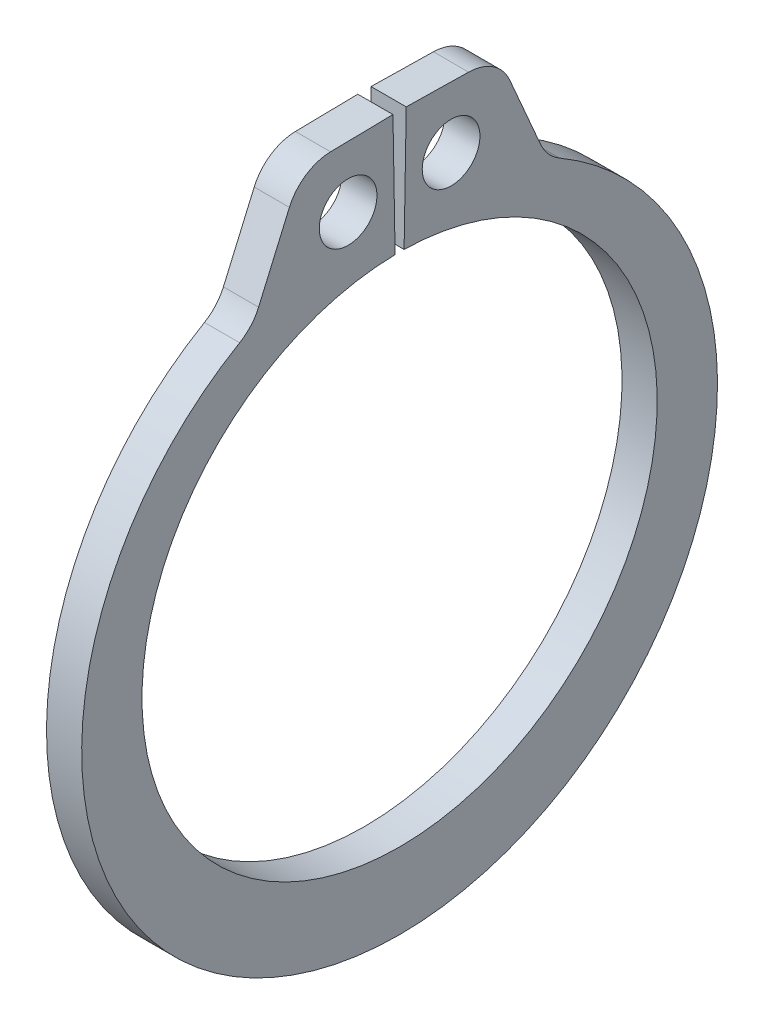
ISO-10303-21;
HEADER;
FILE_DESCRIPTION(('STEP AP214'),'2;1');
FILE_NAME('part.step','',(''),(''),'','','');
FILE_SCHEMA(('AUTOMOTIVE_DESIGN { 1 0 10303 214 1 1 1 1 }'));
ENDSEC;
DATA;
#1=APPLICATION_CONTEXT('core data for automotive mechanical design processes');
#2=APPLICATION_PROTOCOL_DEFINITION('international standard','automotive_design',2000,#1);
#3=PRODUCT_CONTEXT('',#1,'mechanical');
#4=PRODUCT('Part','Part','',(#3));
#5=PRODUCT_RELATED_PRODUCT_CATEGORY('part','',(#4));
#6=PRODUCT_DEFINITION_FORMATION('','',#4);
#7=PRODUCT_DEFINITION_CONTEXT('part definition',#1,'design');
#8=PRODUCT_DEFINITION('design','',#6,#7);
#9=PRODUCT_DEFINITION_SHAPE('','',#8);
#10=(LENGTH_UNIT() NAMED_UNIT(*) SI_UNIT(.MILLI.,.METRE.));
#11=(NAMED_UNIT(*) PLANE_ANGLE_UNIT() SI_UNIT($,.RADIAN.));
#12=(NAMED_UNIT(*) SI_UNIT($,.STERADIAN.) SOLID_ANGLE_UNIT());
#13=UNCERTAINTY_MEASURE_WITH_UNIT(LENGTH_MEASURE(1.E-05),#10,'distance_accuracy_value','');
#14=(GEOMETRIC_REPRESENTATION_CONTEXT(3) GLOBAL_UNCERTAINTY_ASSIGNED_CONTEXT((#13)) GLOBAL_UNIT_ASSIGNED_CONTEXT((#10,
#11,#12)) REPRESENTATION_CONTEXT('',''));
#15=CARTESIAN_POINT('',(0.,0.,0.));
#16=DIRECTION('',(0.,0.,1.));
#17=DIRECTION('',(1.,0.,0.));
#18=AXIS2_PLACEMENT_3D('',#15,#16,#17);
#19=CARTESIAN_POINT('',(0.3175,0.,0.));
#20=DIRECTION('',(1.,0.,0.));
#21=DIRECTION('',(0.,0.,-1.));
#22=AXIS2_PLACEMENT_3D('',#19,#20,#21);
#23=PLANE('',#22);
#24=CARTESIAN_POINT('',(0.3175,5.73776140209981,-0.92895422825804));
#25=DIRECTION('',(-1.,0.,0.));
#26=DIRECTION('',(0.,0.,1.));
#27=AXIS2_PLACEMENT_3D('',#24,#25,#26);
#28=CIRCLE('',#27,0.5207);
#29=CARTESIAN_POINT('',(0.3175,5.73776140209981,-0.40825422825804));
#30=VERTEX_POINT('',#29);
#31=EDGE_CURVE('E107',#30,#30,#28,.T.);
#32=ORIENTED_EDGE('',*,*,#31,.T.);
#33=EDGE_LOOP('',(#32));
#34=FACE_BOUND('',#33,.T.);
#35=CARTESIAN_POINT('',(0.3175,0.,0.));
#36=DIRECTION('',(-1.,0.,0.));
#37=DIRECTION('',(0.,0.,1.));
#38=AXIS2_PLACEMENT_3D('',#35,#36,#37);
#39=CIRCLE('',#38,4.64820000000001);
#40=CARTESIAN_POINT('',(0.3175,4.64749205662594,-0.0811222756017819));
#41=VERTEX_POINT('',#40);
#42=CARTESIAN_POINT('',(0.3175,4.64749205662594,0.0811222756017817));
#43=VERTEX_POINT('',#42);
#44=EDGE_CURVE('E165',#41,#43,#39,.T.);
#45=ORIENTED_EDGE('',*,*,#44,.T.);
#46=DIRECTION('',(0.,-0.999847695156391,-0.0174524064372834));
#47=VECTOR('',#46,1.);
#48=CARTESIAN_POINT('',(0.3175,4.64749205662594,0.0811222756017817));
#49=LINE('',#48,#47);
#50=CARTESIAN_POINT('',(0.3175,6.85695549338253,0.11968860334689));
#51=VERTEX_POINT('',#50);
#52=EDGE_CURVE('E121',#43,#51,#49,.F.);
#53=ORIENTED_EDGE('',*,*,#52,.T.);
#54=DIRECTION('',(0.,0.0174524064372746,-0.999847695156391));
#55=VECTOR('',#54,1.);
#56=CARTESIAN_POINT('',(0.3175,6.85695549338253,0.11968860334689));
#57=LINE('',#56,#55);
#58=CARTESIAN_POINT('',(0.3175,6.83730746393553,1.24532345648589));
#59=VERTEX_POINT('',#58);
#60=EDGE_CURVE('E118',#51,#59,#57,.F.);
#61=ORIENTED_EDGE('',*,*,#60,.T.);
#62=CARTESIAN_POINT('',(0.3175,6.01193319158393,1.23091649497192));
#63=DIRECTION('',(-1.,0.,0.));
#64=DIRECTION('',(0.,0.,1.));
#65=AXIS2_PLACEMENT_3D('',#62,#63,#64);
#66=CIRCLE('',#65,0.8255);
#67=CARTESIAN_POINT('',(0.3175,6.34036860190848,1.98826742502017));
#68=VERTEX_POINT('',#67);
#69=EDGE_CURVE('E111',#68,#59,#66,.T.);
#70=ORIENTED_EDGE('',*,*,#69,.F.);
#71=DIRECTION('',(0.,0.917445099997873,-0.397862398939498));
#72=VECTOR('',#71,1.);
#73=CARTESIAN_POINT('',(0.3175,6.82803074757371,1.77678618091434));
#74=LINE('',#73,#72);
#75=CARTESIAN_POINT('',(0.3175,5.05860230061111,2.54412260972295));
#76=VERTEX_POINT('',#75);
#77=EDGE_CURVE('E106',#68,#76,#74,.F.);
#78=ORIENTED_EDGE('',*,*,#77,.T.);
#79=CARTESIAN_POINT('',(0.3175,5.38703771093567,3.30147353977119));
#80=DIRECTION('',(-1.,0.,0.));
#81=DIRECTION('',(0.,0.,1.));
#82=AXIS2_PLACEMENT_3D('',#79,#80,#81);
#83=CIRCLE('',#82,0.8255);
#84=CARTESIAN_POINT('',(0.3175,4.6736380727081,2.88612885619287));
#85=VERTEX_POINT('',#84);
#86=EDGE_CURVE('E97',#76,#85,#83,.T.);
#87=ORIENTED_EDGE('',*,*,#86,.T.);
#88=CARTESIAN_POINT('',(0.3175,-0.283601933706637,0.));
#89=DIRECTION('',(-1.,0.,0.));
#90=DIRECTION('',(0.,0.,1.));
#91=AXIS2_PLACEMENT_3D('',#88,#89,#90);
#92=CIRCLE('',#91,5.73619806629338);
#93=CARTESIAN_POINT('',(0.3175,4.6736380727081,-2.88612885619287));
#94=VERTEX_POINT('',#93);
#95=EDGE_CURVE('E172',#94,#85,#92,.T.);
#96=ORIENTED_EDGE('',*,*,#95,.F.);
#97=CARTESIAN_POINT('',(0.3175,5.38703771093567,-3.30147353977119));
#98=DIRECTION('',(-1.,0.,0.));
#99=DIRECTION('',(0.,0.,1.));
#100=AXIS2_PLACEMENT_3D('',#97,#98,#99);
#101=CIRCLE('',#100,0.8255);
#102=CARTESIAN_POINT('',(0.3175,5.05860230061111,-2.54412260972295));
#103=VERTEX_POINT('',#102);
#104=EDGE_CURVE('E169',#94,#103,#101,.T.);
#105=ORIENTED_EDGE('',*,*,#104,.T.);
#106=DIRECTION('',(0.,-0.917445099997873,-0.397862398939498));
#107=VECTOR('',#106,1.);
#108=CARTESIAN_POINT('',(0.3175,6.82803074757371,-1.77678618091434));
#109=LINE('',#108,#107);
#110=CARTESIAN_POINT('',(0.3175,6.34036860190848,-1.98826742502017));
#111=VERTEX_POINT('',#110);
#112=EDGE_CURVE('E134',#103,#111,#109,.F.);
#113=ORIENTED_EDGE('',*,*,#112,.T.);
#114=CARTESIAN_POINT('',(0.3175,6.01193319158393,-1.23091649497192));
#115=DIRECTION('',(-1.,0.,0.));
#116=DIRECTION('',(0.,0.,1.));
#117=AXIS2_PLACEMENT_3D('',#114,#115,#116);
#118=CIRCLE('',#117,0.8255);
#119=CARTESIAN_POINT('',(0.3175,6.83730746393553,-1.24532345648589));
#120=VERTEX_POINT('',#119);
#121=EDGE_CURVE('E136',#120,#111,#118,.T.);
#122=ORIENTED_EDGE('',*,*,#121,.F.);
#123=DIRECTION('',(0.,-0.0174524064372746,-0.999847695156391));
#124=VECTOR('',#123,1.);
#125=CARTESIAN_POINT('',(0.3175,6.85695549338253,-0.11968860334689));
#126=LINE('',#125,#124);
#127=CARTESIAN_POINT('',(0.3175,6.85695549338253,-0.11968860334689));
#128=VERTEX_POINT('',#127);
#129=EDGE_CURVE('E130',#120,#128,#126,.F.);
#130=ORIENTED_EDGE('',*,*,#129,.T.);
#131=DIRECTION('',(0.,0.999847695156391,-0.0174524064372834));
#132=VECTOR('',#131,1.);
#133=CARTESIAN_POINT('',(0.3175,4.64749205662594,-0.0811222756017817));
#134=LINE('',#133,#132);
#135=EDGE_CURVE('E125',#128,#41,#134,.F.);
#136=ORIENTED_EDGE('',*,*,#135,.T.);
#137=EDGE_LOOP('',(#45,#53,#61,#70,#78,#87,#96,#105,#113,#122,#130,#136));
#138=FACE_BOUND('',#137,.T.);
#139=CARTESIAN_POINT('',(0.3175,5.73776140209981,0.92895422825804));
#140=DIRECTION('',(-1.,0.,0.));
#141=DIRECTION('',(0.,0.,1.));
#142=AXIS2_PLACEMENT_3D('',#139,#140,#141);
#143=CIRCLE('',#142,0.5207);
#144=CARTESIAN_POINT('',(0.3175,5.73776140209981,1.44965422825804));
#145=VERTEX_POINT('',#144);
#146=EDGE_CURVE('E19',#145,#145,#143,.T.);
#147=ORIENTED_EDGE('',*,*,#146,.T.);
#148=EDGE_LOOP('',(#147));
#149=FACE_BOUND('',#148,.T.);
#150=ADVANCED_FACE('F16',(#34,#138,#149),#23,.T.);
#151=CARTESIAN_POINT('',(0.3175,5.73776140209981,0.92895422825804));
#152=DIRECTION('',(-1.,0.,0.));
#153=DIRECTION('',(0.,0.,1.));
#154=AXIS2_PLACEMENT_3D('',#151,#152,#153);
#155=CYLINDRICAL_SURFACE('',#154,0.5207);
#156=CARTESIAN_POINT('',(-0.3175,5.73776140209981,0.92895422825804));
#157=DIRECTION('',(-1.,0.,0.));
#158=DIRECTION('',(0.,0.,1.));
#159=AXIS2_PLACEMENT_3D('',#156,#157,#158);
#160=CIRCLE('',#159,0.5207);
#161=CARTESIAN_POINT('',(-0.3175,5.73776140209981,1.44965422825804));
#162=VERTEX_POINT('',#161);
#163=EDGE_CURVE('E159',#162,#162,#160,.T.);
#164=ORIENTED_EDGE('',*,*,#163,.T.);
#165=EDGE_LOOP('',(#164));
#166=FACE_BOUND('',#165,.T.);
#167=ORIENTED_EDGE('',*,*,#146,.F.);
#168=EDGE_LOOP('',(#167));
#169=FACE_BOUND('',#168,.T.);
#170=ADVANCED_FACE('F367',(#166,#169),#155,.F.);
#171=CARTESIAN_POINT('',(0.3175,5.38703771093567,3.30147353977119));
#172=DIRECTION('',(-1.,0.,0.));
#173=DIRECTION('',(0.,0.,1.));
#174=AXIS2_PLACEMENT_3D('',#171,#172,#173);
#175=CYLINDRICAL_SURFACE('',#174,0.8255);
#176=DIRECTION('',(1.,0.,0.));
#177=VECTOR('',#176,1.);
#178=CARTESIAN_POINT('',(0.3175,5.05860230061111,2.54412260972295));
#179=LINE('',#178,#177);
#180=CARTESIAN_POINT('',(-0.3175,5.05860230061111,2.54412260972295));
#181=VERTEX_POINT('',#180);
#182=EDGE_CURVE('E101',#76,#181,#179,.F.);
#183=ORIENTED_EDGE('',*,*,#182,.T.);
#184=CARTESIAN_POINT('',(-0.3175,5.38703771093567,3.30147353977119));
#185=DIRECTION('',(-1.,0.,0.));
#186=DIRECTION('',(0.,0.,1.));
#187=AXIS2_PLACEMENT_3D('',#184,#185,#186);
#188=CIRCLE('',#187,0.8255);
#189=CARTESIAN_POINT('',(-0.3175,4.6736380727081,2.88612885619287));
#190=VERTEX_POINT('',#189);
#191=EDGE_CURVE('E157',#181,#190,#188,.T.);
#192=ORIENTED_EDGE('',*,*,#191,.T.);
#193=DIRECTION('',(-1.,0.,0.));
#194=VECTOR('',#193,1.);
#195=CARTESIAN_POINT('',(0.3175,4.6736380727081,2.88612885619287));
#196=LINE('',#195,#194);
#197=EDGE_CURVE('E102',#85,#190,#196,.T.);
#198=ORIENTED_EDGE('',*,*,#197,.F.);
#199=ORIENTED_EDGE('',*,*,#86,.F.);
#200=EDGE_LOOP('',(#183,#192,#198,#199));
#201=FACE_BOUND('',#200,.T.);
#202=ADVANCED_FACE('F99',(#201),#175,.F.);
#203=CARTESIAN_POINT('',(0.3175,-0.283601933706637,0.));
#204=DIRECTION('',(-1.,0.,0.));
#205=DIRECTION('',(0.,0.,1.));
#206=AXIS2_PLACEMENT_3D('',#203,#204,#205);
#207=CYLINDRICAL_SURFACE('',#206,5.73619806629338);
#208=CARTESIAN_POINT('',(-0.3175,-0.283601933706637,0.));
#209=DIRECTION('',(-1.,0.,0.));
#210=DIRECTION('',(0.,0.,1.));
#211=AXIS2_PLACEMENT_3D('',#208,#209,#210);
#212=CIRCLE('',#211,5.73619806629338);
#213=CARTESIAN_POINT('',(-0.3175,4.6736380727081,-2.88612885619287));
#214=VERTEX_POINT('',#213);
#215=EDGE_CURVE('E155',#190,#214,#212,.F.);
#216=ORIENTED_EDGE('',*,*,#215,.T.);
#217=DIRECTION('',(-1.,0.,0.));
#218=VECTOR('',#217,1.);
#219=CARTESIAN_POINT('',(0.3175,4.6736380727081,-2.88612885619287));
#220=LINE('',#219,#218);
#221=EDGE_CURVE('E171',#214,#94,#220,.F.);
#222=ORIENTED_EDGE('',*,*,#221,.T.);
#223=ORIENTED_EDGE('',*,*,#95,.T.);
#224=ORIENTED_EDGE('',*,*,#197,.T.);
#225=EDGE_LOOP('',(#216,#222,#223,#224));
#226=FACE_BOUND('',#225,.T.);
#227=ADVANCED_FACE('F177',(#226),#207,.T.);
#228=CARTESIAN_POINT('',(0.3175,5.38703771093567,-3.30147353977119));
#229=DIRECTION('',(-1.,0.,0.));
#230=DIRECTION('',(0.,0.,1.));
#231=AXIS2_PLACEMENT_3D('',#228,#229,#230);
#232=CYLINDRICAL_SURFACE('',#231,0.8255);
#233=ORIENTED_EDGE('',*,*,#221,.F.);
#234=CARTESIAN_POINT('',(-0.3175,5.38703771093567,-3.30147353977119));
#235=DIRECTION('',(-1.,0.,0.));
#236=DIRECTION('',(0.,0.,1.));
#237=AXIS2_PLACEMENT_3D('',#234,#235,#236);
#238=CIRCLE('',#237,0.8255);
#239=CARTESIAN_POINT('',(-0.3175,5.05860230061111,-2.54412260972295));
#240=VERTEX_POINT('',#239);
#241=EDGE_CURVE('E152',#214,#240,#238,.T.);
#242=ORIENTED_EDGE('',*,*,#241,.T.);
#243=DIRECTION('',(1.,0.,0.));
#244=VECTOR('',#243,1.);
#245=CARTESIAN_POINT('',(0.3175,5.05860230061111,-2.54412260972295));
#246=LINE('',#245,#244);
#247=EDGE_CURVE('E137',#240,#103,#246,.T.);
#248=ORIENTED_EDGE('',*,*,#247,.T.);
#249=ORIENTED_EDGE('',*,*,#104,.F.);
#250=EDGE_LOOP('',(#233,#242,#248,#249));
#251=FACE_BOUND('',#250,.T.);
#252=ADVANCED_FACE('F189',(#251),#232,.F.);
#253=CARTESIAN_POINT('',(0.3175,6.82803074757371,-1.77678618091434));
#254=DIRECTION('',(0.,-0.397862398939498,0.917445099997873));
#255=DIRECTION('',(0.,-0.917445099997873,-0.397862398939498));
#256=AXIS2_PLACEMENT_3D('',#253,#254,#255);
#257=PLANE('',#256);
#258=ORIENTED_EDGE('',*,*,#247,.F.);
#259=DIRECTION('',(0.,0.917445099997873,0.397862398939498));
#260=VECTOR('',#259,1.);
#261=CARTESIAN_POINT('',(-0.3175,5.05860230061111,-2.54412260972295));
#262=LINE('',#261,#260);
#263=CARTESIAN_POINT('',(-0.3175,6.34036860190848,-1.98826742502017));
#264=VERTEX_POINT('',#263);
#265=EDGE_CURVE('E151',#240,#264,#262,.T.);
#266=ORIENTED_EDGE('',*,*,#265,.T.);
#267=DIRECTION('',(-1.,0.,0.));
#268=VECTOR('',#267,1.);
#269=CARTESIAN_POINT('',(0.3175,6.34036860190848,-1.98826742502017));
#270=LINE('',#269,#268);
#271=EDGE_CURVE('E168',#111,#264,#270,.T.);
#272=ORIENTED_EDGE('',*,*,#271,.F.);
#273=ORIENTED_EDGE('',*,*,#112,.F.);
#274=EDGE_LOOP('',(#258,#266,#272,#273));
#275=FACE_BOUND('',#274,.T.);
#276=ADVANCED_FACE('F194',(#275),#257,.F.);
#277=CARTESIAN_POINT('',(0.3175,6.01193319158393,-1.23091649497192));
#278=DIRECTION('',(-1.,0.,0.));
#279=DIRECTION('',(0.,0.,1.));
#280=AXIS2_PLACEMENT_3D('',#277,#278,#279);
#281=CYLINDRICAL_SURFACE('',#280,0.8255);
#282=CARTESIAN_POINT('',(-0.3175,6.01193319158393,-1.23091649497192));
#283=DIRECTION('',(-1.,0.,0.));
#284=DIRECTION('',(0.,0.,1.));
#285=AXIS2_PLACEMENT_3D('',#282,#283,#284);
#286=CIRCLE('',#285,0.8255);
#287=CARTESIAN_POINT('',(-0.3175,6.83730746393553,-1.24532345648589));
#288=VERTEX_POINT('',#287);
#289=EDGE_CURVE('E147',#264,#288,#286,.F.);
#290=ORIENTED_EDGE('',*,*,#289,.T.);
#291=DIRECTION('',(1.,0.,0.));
#292=VECTOR('',#291,1.);
#293=CARTESIAN_POINT('',(0.3175,6.83730746393553,-1.24532345648589));
#294=LINE('',#293,#292);
#295=EDGE_CURVE('E133',#288,#120,#294,.T.);
#296=ORIENTED_EDGE('',*,*,#295,.T.);
#297=ORIENTED_EDGE('',*,*,#121,.T.);
#298=ORIENTED_EDGE('',*,*,#271,.T.);
#299=EDGE_LOOP('',(#290,#296,#297,#298));
#300=FACE_BOUND('',#299,.T.);
#301=ADVANCED_FACE('F245',(#300),#281,.T.);
#302=CARTESIAN_POINT('',(0.3175,6.85695549338253,-0.11968860334689));
#303=DIRECTION('',(0.,-0.999847695156391,0.0174524064372746));
#304=DIRECTION('',(0.,-0.0174524064372746,-0.999847695156391));
#305=AXIS2_PLACEMENT_3D('',#302,#303,#304);
#306=PLANE('',#305);
#307=ORIENTED_EDGE('',*,*,#295,.F.);
#308=DIRECTION('',(0.,0.0174524064372745,0.999847695156391));
#309=VECTOR('',#308,1.);
#310=CARTESIAN_POINT('',(-0.3175,6.83730746393553,-1.24532345648589));
#311=LINE('',#310,#309);
#312=CARTESIAN_POINT('',(-0.3175,6.85695549338253,-0.11968860334689));
#313=VERTEX_POINT('',#312);
#314=EDGE_CURVE('E150',#288,#313,#311,.T.);
#315=ORIENTED_EDGE('',*,*,#314,.T.);
#316=DIRECTION('',(1.,0.,0.));
#317=VECTOR('',#316,1.);
#318=CARTESIAN_POINT('',(0.3175,6.85695549338253,-0.11968860334689));
#319=LINE('',#318,#317);
#320=EDGE_CURVE('E129',#313,#128,#319,.T.);
#321=ORIENTED_EDGE('',*,*,#320,.T.);
#322=ORIENTED_EDGE('',*,*,#129,.F.);
#323=EDGE_LOOP('',(#307,#315,#321,#322));
#324=FACE_BOUND('',#323,.T.);
#325=ADVANCED_FACE('F243',(#324),#306,.F.);
#326=CARTESIAN_POINT('',(0.3175,4.64749205662594,-0.0811222756017817));
#327=DIRECTION('',(0.,-0.0174524064372834,-0.999847695156391));
#328=DIRECTION('',(0.,0.999847695156391,-0.0174524064372834));
#329=AXIS2_PLACEMENT_3D('',#326,#327,#328);
#330=PLANE('',#329);
#331=DIRECTION('',(-1.,0.,0.));
#332=VECTOR('',#331,1.);
#333=CARTESIAN_POINT('',(0.3175,4.64749205662594,-0.0811222756017822));
#334=LINE('',#333,#332);
#335=CARTESIAN_POINT('',(-0.3175,4.64749205662594,-0.0811222756017819));
#336=VERTEX_POINT('',#335);
#337=EDGE_CURVE('E128',#336,#41,#334,.F.);
#338=ORIENTED_EDGE('',*,*,#337,.T.);
#339=ORIENTED_EDGE('',*,*,#135,.F.);
#340=ORIENTED_EDGE('',*,*,#320,.F.);
#341=DIRECTION('',(0.,-0.999847695156391,0.0174524064372834));
#342=VECTOR('',#341,1.);
#343=CARTESIAN_POINT('',(-0.3175,6.85695549338253,-0.11968860334689));
#344=LINE('',#343,#342);
#345=EDGE_CURVE('E146',#313,#336,#344,.T.);
#346=ORIENTED_EDGE('',*,*,#345,.T.);
#347=EDGE_LOOP('',(#338,#339,#340,#346));
#348=FACE_BOUND('',#347,.T.);
#349=ADVANCED_FACE('F238',(#348),#330,.F.);
#350=CARTESIAN_POINT('',(0.3175,0.,0.));
#351=DIRECTION('',(-1.,0.,0.));
#352=DIRECTION('',(0.,0.,1.));
#353=AXIS2_PLACEMENT_3D('',#350,#351,#352);
#354=CYLINDRICAL_SURFACE('',#353,4.64820000000001);
#355=ORIENTED_EDGE('',*,*,#44,.F.);
#356=ORIENTED_EDGE('',*,*,#337,.F.);
#357=CARTESIAN_POINT('',(-0.3175,0.,0.));
#358=DIRECTION('',(-1.,0.,0.));
#359=DIRECTION('',(0.,0.,1.));
#360=AXIS2_PLACEMENT_3D('',#357,#358,#359);
#361=CIRCLE('',#360,4.64820000000001);
#362=CARTESIAN_POINT('',(-0.3175,4.64749205662594,0.0811222756017817));
#363=VERTEX_POINT('',#362);
#364=EDGE_CURVE('E143',#336,#363,#361,.T.);
#365=ORIENTED_EDGE('',*,*,#364,.T.);
#366=DIRECTION('',(1.,0.,0.));
#367=VECTOR('',#366,1.);
#368=CARTESIAN_POINT('',(0.3175,4.64749205662594,0.0811222756017817));
#369=LINE('',#368,#367);
#370=EDGE_CURVE('E124',#363,#43,#369,.T.);
#371=ORIENTED_EDGE('',*,*,#370,.T.);
#372=EDGE_LOOP('',(#355,#356,#365,#371));
#373=FACE_BOUND('',#372,.T.);
#374=ADVANCED_FACE('F233',(#373),#354,.F.);
#375=CARTESIAN_POINT('',(0.3175,4.64749205662594,0.0811222756017817));
#376=DIRECTION('',(0.,-0.0174524064372834,0.999847695156391));
#377=DIRECTION('',(0.,-0.999847695156391,-0.0174524064372834));
#378=AXIS2_PLACEMENT_3D('',#375,#376,#377);
#379=PLANE('',#378);
#380=DIRECTION('',(1.,0.,0.));
#381=VECTOR('',#380,1.);
#382=CARTESIAN_POINT('',(0.3175,6.85695549338253,0.11968860334689));
#383=LINE('',#382,#381);
#384=CARTESIAN_POINT('',(-0.3175,6.85695549338253,0.11968860334689));
#385=VERTEX_POINT('',#384);
#386=EDGE_CURVE('E120',#385,#51,#383,.T.);
#387=ORIENTED_EDGE('',*,*,#386,.T.);
#388=ORIENTED_EDGE('',*,*,#52,.F.);
#389=ORIENTED_EDGE('',*,*,#370,.F.);
#390=DIRECTION('',(0.,0.999847695156391,0.0174524064372834));
#391=VECTOR('',#390,1.);
#392=CARTESIAN_POINT('',(-0.3175,4.64749205662594,0.0811222756017817));
#393=LINE('',#392,#391);
#394=EDGE_CURVE('E145',#363,#385,#393,.T.);
#395=ORIENTED_EDGE('',*,*,#394,.T.);
#396=EDGE_LOOP('',(#387,#388,#389,#395));
#397=FACE_BOUND('',#396,.T.);
#398=ADVANCED_FACE('F230',(#397),#379,.F.);
#399=CARTESIAN_POINT('',(0.3175,6.85695549338253,0.11968860334689));
#400=DIRECTION('',(0.,-0.999847695156391,-0.0174524064372746));
#401=DIRECTION('',(0.,0.0174524064372746,-0.999847695156391));
#402=AXIS2_PLACEMENT_3D('',#399,#400,#401);
#403=PLANE('',#402);
#404=DIRECTION('',(-1.,0.,0.));
#405=VECTOR('',#404,1.);
#406=CARTESIAN_POINT('',(0.3175,6.83730746393553,1.24532345648589));
#407=LINE('',#406,#405);
#408=CARTESIAN_POINT('',(-0.3175,6.83730746393553,1.24532345648589));
#409=VERTEX_POINT('',#408);
#410=EDGE_CURVE('E113',#59,#409,#407,.T.);
#411=ORIENTED_EDGE('',*,*,#410,.F.);
#412=ORIENTED_EDGE('',*,*,#60,.F.);
#413=ORIENTED_EDGE('',*,*,#386,.F.);
#414=DIRECTION('',(0.,-0.0174524064372745,0.999847695156391));
#415=VECTOR('',#414,1.);
#416=CARTESIAN_POINT('',(-0.3175,6.85695549338253,0.11968860334689));
#417=LINE('',#416,#415);
#418=EDGE_CURVE('E142',#385,#409,#417,.T.);
#419=ORIENTED_EDGE('',*,*,#418,.T.);
#420=EDGE_LOOP('',(#411,#412,#413,#419));
#421=FACE_BOUND('',#420,.T.);
#422=ADVANCED_FACE('F223',(#421),#403,.F.);
#423=CARTESIAN_POINT('',(0.3175,6.01193319158393,1.23091649497192));
#424=DIRECTION('',(-1.,0.,0.));
#425=DIRECTION('',(0.,0.,1.));
#426=AXIS2_PLACEMENT_3D('',#423,#424,#425);
#427=CYLINDRICAL_SURFACE('',#426,0.8255);
#428=CARTESIAN_POINT('',(-0.3175,6.01193319158393,1.23091649497192));
#429=DIRECTION('',(-1.,0.,0.));
#430=DIRECTION('',(0.,0.,1.));
#431=AXIS2_PLACEMENT_3D('',#428,#429,#430);
#432=CIRCLE('',#431,0.8255);
#433=CARTESIAN_POINT('',(-0.3175,6.34036860190848,1.98826742502017));
#434=VERTEX_POINT('',#433);
#435=EDGE_CURVE('E139',#409,#434,#432,.F.);
#436=ORIENTED_EDGE('',*,*,#435,.T.);
#437=DIRECTION('',(1.,0.,0.));
#438=VECTOR('',#437,1.);
#439=CARTESIAN_POINT('',(0.3175,6.34036860190848,1.98826742502017));
#440=LINE('',#439,#438);
#441=EDGE_CURVE('E34',#434,#68,#440,.T.);
#442=ORIENTED_EDGE('',*,*,#441,.T.);
#443=ORIENTED_EDGE('',*,*,#69,.T.);
#444=ORIENTED_EDGE('',*,*,#410,.T.);
#445=EDGE_LOOP('',(#436,#442,#443,#444));
#446=FACE_BOUND('',#445,.T.);
#447=ADVANCED_FACE('F268',(#446),#427,.T.);
#448=CARTESIAN_POINT('',(0.3175,6.82803074757371,1.77678618091434));
#449=DIRECTION('',(0.,-0.397862398939498,-0.917445099997873));
#450=DIRECTION('',(0.,0.917445099997873,-0.397862398939498));
#451=AXIS2_PLACEMENT_3D('',#448,#449,#450);
#452=PLANE('',#451);
#453=ORIENTED_EDGE('',*,*,#182,.F.);
#454=ORIENTED_EDGE('',*,*,#77,.F.);
#455=ORIENTED_EDGE('',*,*,#441,.F.);
#456=DIRECTION('',(0.,-0.917445099997873,0.397862398939498));
#457=VECTOR('',#456,1.);
#458=CARTESIAN_POINT('',(-0.3175,6.34036860190848,1.98826742502017));
#459=LINE('',#458,#457);
#460=EDGE_CURVE('E25',#434,#181,#459,.T.);
#461=ORIENTED_EDGE('',*,*,#460,.T.);
#462=EDGE_LOOP('',(#453,#454,#455,#461));
#463=FACE_BOUND('',#462,.T.);
#464=ADVANCED_FACE('F105',(#463),#452,.F.);
#465=CARTESIAN_POINT('',(0.3175,5.73776140209981,-0.92895422825804));
#466=DIRECTION('',(-1.,0.,0.));
#467=DIRECTION('',(0.,0.,1.));
#468=AXIS2_PLACEMENT_3D('',#465,#466,#467);
#469=CYLINDRICAL_SURFACE('',#468,0.5207);
#470=CARTESIAN_POINT('',(-0.3175,5.73776140209981,-0.92895422825804));
#471=DIRECTION('',(-1.,0.,0.));
#472=DIRECTION('',(0.,0.,1.));
#473=AXIS2_PLACEMENT_3D('',#470,#471,#472);
#474=CIRCLE('',#473,0.5207);
#475=CARTESIAN_POINT('',(-0.3175,5.73776140209981,-0.40825422825804));
#476=VERTEX_POINT('',#475);
#477=EDGE_CURVE('E9',#476,#476,#474,.T.);
#478=ORIENTED_EDGE('',*,*,#477,.T.);
#479=EDGE_LOOP('',(#478));
#480=FACE_BOUND('',#479,.T.);
#481=ORIENTED_EDGE('',*,*,#31,.F.);
#482=EDGE_LOOP('',(#481));
#483=FACE_BOUND('',#482,.T.);
#484=ADVANCED_FACE('F256',(#480,#483),#469,.F.);
#485=CARTESIAN_POINT('',(-0.3175,0.,0.));
#486=DIRECTION('',(1.,0.,0.));
#487=DIRECTION('',(0.,0.,-1.));
#488=AXIS2_PLACEMENT_3D('',#485,#486,#487);
#489=PLANE('',#488);
#490=ORIENTED_EDGE('',*,*,#477,.F.);
#491=EDGE_LOOP('',(#490));
#492=FACE_BOUND('',#491,.T.);
#493=ORIENTED_EDGE('',*,*,#435,.F.);
#494=ORIENTED_EDGE('',*,*,#418,.F.);
#495=ORIENTED_EDGE('',*,*,#394,.F.);
#496=ORIENTED_EDGE('',*,*,#364,.F.);
#497=ORIENTED_EDGE('',*,*,#345,.F.);
#498=ORIENTED_EDGE('',*,*,#314,.F.);
#499=ORIENTED_EDGE('',*,*,#289,.F.);
#500=ORIENTED_EDGE('',*,*,#265,.F.);
#501=ORIENTED_EDGE('',*,*,#241,.F.);
#502=ORIENTED_EDGE('',*,*,#215,.F.);
#503=ORIENTED_EDGE('',*,*,#191,.F.);
#504=ORIENTED_EDGE('',*,*,#460,.F.);
#505=EDGE_LOOP('',(#493,#494,#495,#496,#497,#498,#499,#500,#501,#502,#503,#504));
#506=FACE_BOUND('',#505,.T.);
#507=ORIENTED_EDGE('',*,*,#163,.F.);
#508=EDGE_LOOP('',(#507));
#509=FACE_BOUND('',#508,.T.);
#510=ADVANCED_FACE('F182',(#492,#506,#509),#489,.F.);
#511=CLOSED_SHELL('',(#150,#170,#202,#227,#252,#276,#301,#325,#349,#374,#398,#422,#447,#464,
#484,#510));
#512=MANIFOLD_SOLID_BREP('B1',#511);
#513=ADVANCED_BREP_SHAPE_REPRESENTATION('',(#18,#512),#14);
#514=SHAPE_DEFINITION_REPRESENTATION(#9,#513);
ENDSEC;
END-ISO-10303-21;
